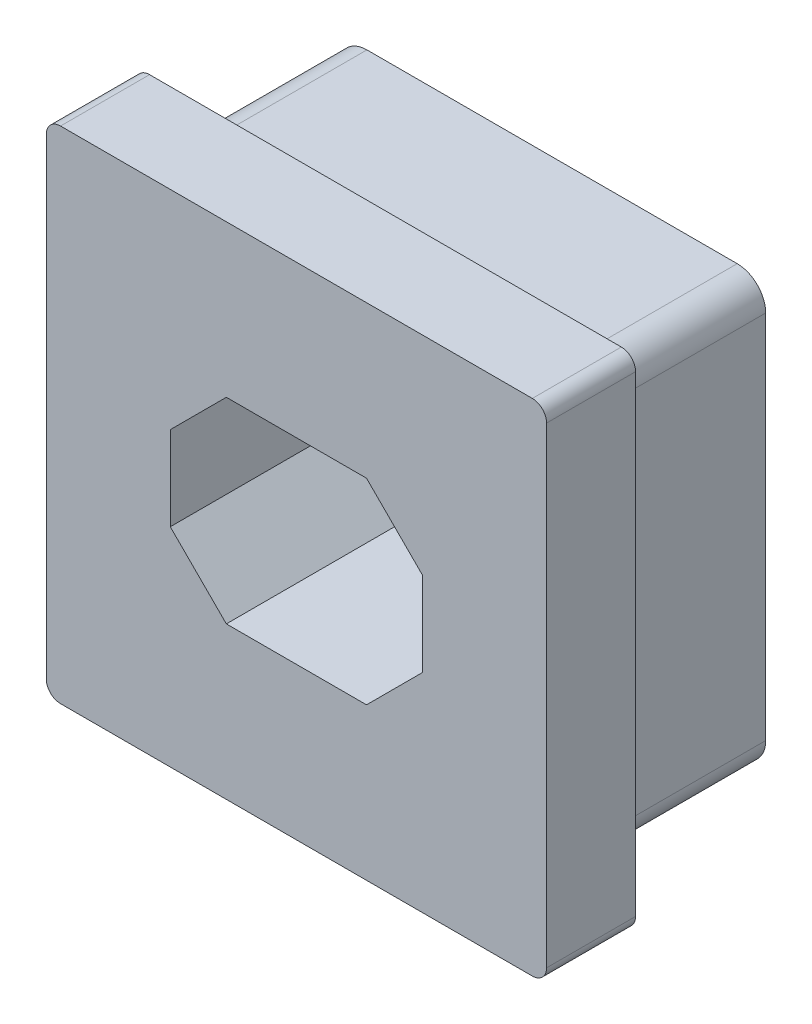
ISO-10303-21;
HEADER;
FILE_DESCRIPTION(('STEP AP214'),'2;1');
FILE_NAME('part.step','',(''),(''),'','','');
FILE_SCHEMA(('AUTOMOTIVE_DESIGN { 1 0 10303 214 1 1 1 1 }'));
ENDSEC;
DATA;
#1=APPLICATION_CONTEXT('core data for automotive mechanical design processes');
#2=APPLICATION_PROTOCOL_DEFINITION('international standard','automotive_design',2000,#1);
#3=PRODUCT_CONTEXT('',#1,'mechanical');
#4=PRODUCT('Part','Part','',(#3));
#5=PRODUCT_RELATED_PRODUCT_CATEGORY('part','',(#4));
#6=PRODUCT_DEFINITION_FORMATION('','',#4);
#7=PRODUCT_DEFINITION_CONTEXT('part definition',#1,'design');
#8=PRODUCT_DEFINITION('design','',#6,#7);
#9=PRODUCT_DEFINITION_SHAPE('','',#8);
#10=(LENGTH_UNIT() NAMED_UNIT(*) SI_UNIT(.MILLI.,.METRE.));
#11=(NAMED_UNIT(*) PLANE_ANGLE_UNIT() SI_UNIT($,.RADIAN.));
#12=(NAMED_UNIT(*) SI_UNIT($,.STERADIAN.) SOLID_ANGLE_UNIT());
#13=UNCERTAINTY_MEASURE_WITH_UNIT(LENGTH_MEASURE(1.E-05),#10,'distance_accuracy_value','');
#14=(GEOMETRIC_REPRESENTATION_CONTEXT(3) GLOBAL_UNCERTAINTY_ASSIGNED_CONTEXT((#13)) GLOBAL_UNIT_ASSIGNED_CONTEXT((#10,
#11,#12)) REPRESENTATION_CONTEXT('',''));
#15=CARTESIAN_POINT('',(0.,0.,0.));
#16=DIRECTION('',(0.,0.,1.));
#17=DIRECTION('',(1.,0.,0.));
#18=AXIS2_PLACEMENT_3D('',#15,#16,#17);
#19=CARTESIAN_POINT('',(4.207,4.207,0.));
#20=DIRECTION('',(0.,0.,1.));
#21=DIRECTION('',(1.,0.,0.));
#22=AXIS2_PLACEMENT_3D('',#19,#20,#21);
#23=PLANE('',#22);
#24=CARTESIAN_POINT('',(4.207,4.207,0.));
#25=DIRECTION('',(0.,0.,1.));
#26=DIRECTION('',(1.,0.,0.));
#27=AXIS2_PLACEMENT_3D('',#24,#25,#26);
#28=CIRCLE('',#27,0.254000000000002);
#29=CARTESIAN_POINT('',(4.461,4.207,0.));
#30=VERTEX_POINT('',#29);
#31=CARTESIAN_POINT('',(4.207,4.461,0.));
#32=VERTEX_POINT('',#31);
#33=EDGE_CURVE('E276',#30,#32,#28,.T.);
#34=ORIENTED_EDGE('',*,*,#33,.F.);
#35=DIRECTION('',(0.,1.,0.));
#36=VECTOR('',#35,1.);
#37=CARTESIAN_POINT('',(4.461,-4.207,0.));
#38=LINE('',#37,#36);
#39=CARTESIAN_POINT('',(4.461,-4.207,0.));
#40=VERTEX_POINT('',#39);
#41=EDGE_CURVE('E281',#40,#30,#38,.T.);
#42=ORIENTED_EDGE('',*,*,#41,.F.);
#43=CARTESIAN_POINT('',(4.207,-4.207,0.));
#44=DIRECTION('',(0.,0.,1.));
#45=DIRECTION('',(1.,0.,0.));
#46=AXIS2_PLACEMENT_3D('',#43,#44,#45);
#47=CIRCLE('',#46,0.254);
#48=CARTESIAN_POINT('',(4.207,-4.461,0.));
#49=VERTEX_POINT('',#48);
#50=EDGE_CURVE('E308',#49,#40,#47,.T.);
#51=ORIENTED_EDGE('',*,*,#50,.F.);
#52=DIRECTION('',(1.,0.,0.));
#53=VECTOR('',#52,1.);
#54=CARTESIAN_POINT('',(-4.207,-4.461,0.));
#55=LINE('',#54,#53);
#56=CARTESIAN_POINT('',(-4.207,-4.461,0.));
#57=VERTEX_POINT('',#56);
#58=EDGE_CURVE('E306',#57,#49,#55,.T.);
#59=ORIENTED_EDGE('',*,*,#58,.F.);
#60=CARTESIAN_POINT('',(-4.207,-4.207,0.));
#61=DIRECTION('',(0.,0.,1.));
#62=DIRECTION('',(1.,0.,0.));
#63=AXIS2_PLACEMENT_3D('',#60,#61,#62);
#64=CIRCLE('',#63,0.254000000000003);
#65=CARTESIAN_POINT('',(-4.461,-4.207,0.));
#66=VERTEX_POINT('',#65);
#67=EDGE_CURVE('E304',#66,#57,#64,.T.);
#68=ORIENTED_EDGE('',*,*,#67,.F.);
#69=DIRECTION('',(0.,-1.,0.));
#70=VECTOR('',#69,1.);
#71=CARTESIAN_POINT('',(-4.461,4.207,0.));
#72=LINE('',#71,#70);
#73=CARTESIAN_POINT('',(-4.461,4.207,0.));
#74=VERTEX_POINT('',#73);
#75=EDGE_CURVE('E302',#74,#66,#72,.T.);
#76=ORIENTED_EDGE('',*,*,#75,.F.);
#77=CARTESIAN_POINT('',(-4.207,4.207,0.));
#78=DIRECTION('',(0.,0.,1.));
#79=DIRECTION('',(1.,0.,0.));
#80=AXIS2_PLACEMENT_3D('',#77,#78,#79);
#81=CIRCLE('',#80,0.254);
#82=CARTESIAN_POINT('',(-4.207,4.461,0.));
#83=VERTEX_POINT('',#82);
#84=EDGE_CURVE('E300',#83,#74,#81,.T.);
#85=ORIENTED_EDGE('',*,*,#84,.F.);
#86=DIRECTION('',(-1.,0.,0.));
#87=VECTOR('',#86,1.);
#88=CARTESIAN_POINT('',(4.207,4.461,0.));
#89=LINE('',#88,#87);
#90=EDGE_CURVE('E298',#32,#83,#89,.T.);
#91=ORIENTED_EDGE('',*,*,#90,.F.);
#92=EDGE_LOOP('',(#34,#42,#51,#59,#68,#76,#85,#91));
#93=FACE_BOUND('',#92,.T.);
#94=DIRECTION('',(0.,-1.,0.));
#95=VECTOR('',#94,1.);
#96=CARTESIAN_POINT('',(3.81,-3.81,0.));
#97=LINE('',#96,#95);
#98=CARTESIAN_POINT('',(3.81,3.302,0.));
#99=VERTEX_POINT('',#98);
#100=CARTESIAN_POINT('',(3.81,-3.302,0.));
#101=VERTEX_POINT('',#100);
#102=EDGE_CURVE('E243',#99,#101,#97,.T.);
#103=ORIENTED_EDGE('',*,*,#102,.F.);
#104=CARTESIAN_POINT('',(3.302,3.302,0.));
#105=DIRECTION('',(0.,0.,1.));
#106=DIRECTION('',(1.,0.,0.));
#107=AXIS2_PLACEMENT_3D('',#104,#105,#106);
#108=CIRCLE('',#107,0.508);
#109=CARTESIAN_POINT('',(3.302,3.81,0.));
#110=VERTEX_POINT('',#109);
#111=EDGE_CURVE('E382',#99,#110,#108,.T.);
#112=ORIENTED_EDGE('',*,*,#111,.T.);
#113=DIRECTION('',(1.,0.,0.));
#114=VECTOR('',#113,1.);
#115=CARTESIAN_POINT('',(-3.81,3.81,0.));
#116=LINE('',#115,#114);
#117=CARTESIAN_POINT('',(-3.302,3.81,0.));
#118=VERTEX_POINT('',#117);
#119=EDGE_CURVE('E248',#118,#110,#116,.T.);
#120=ORIENTED_EDGE('',*,*,#119,.F.);
#121=CARTESIAN_POINT('',(-3.302,3.302,0.));
#122=DIRECTION('',(0.,0.,1.));
#123=DIRECTION('',(1.,0.,0.));
#124=AXIS2_PLACEMENT_3D('',#121,#122,#123);
#125=CIRCLE('',#124,0.508);
#126=CARTESIAN_POINT('',(-3.81,3.302,0.));
#127=VERTEX_POINT('',#126);
#128=EDGE_CURVE('E384',#118,#127,#125,.T.);
#129=ORIENTED_EDGE('',*,*,#128,.T.);
#130=DIRECTION('',(0.,1.,0.));
#131=VECTOR('',#130,1.);
#132=CARTESIAN_POINT('',(-3.81,-3.81,0.));
#133=LINE('',#132,#131);
#134=CARTESIAN_POINT('',(-3.81,-3.302,0.));
#135=VERTEX_POINT('',#134);
#136=EDGE_CURVE('E262',#135,#127,#133,.T.);
#137=ORIENTED_EDGE('',*,*,#136,.F.);
#138=CARTESIAN_POINT('',(-3.302,-3.302,0.));
#139=DIRECTION('',(0.,0.,1.));
#140=DIRECTION('',(1.,0.,0.));
#141=AXIS2_PLACEMENT_3D('',#138,#139,#140);
#142=CIRCLE('',#141,0.508);
#143=CARTESIAN_POINT('',(-3.302,-3.81,0.));
#144=VERTEX_POINT('',#143);
#145=EDGE_CURVE('E47',#135,#144,#142,.T.);
#146=ORIENTED_EDGE('',*,*,#145,.T.);
#147=DIRECTION('',(-1.,0.,0.));
#148=VECTOR('',#147,1.);
#149=CARTESIAN_POINT('',(-3.81,-3.81,0.));
#150=LINE('',#149,#148);
#151=CARTESIAN_POINT('',(3.302,-3.81,0.));
#152=VERTEX_POINT('',#151);
#153=EDGE_CURVE('E260',#152,#144,#150,.T.);
#154=ORIENTED_EDGE('',*,*,#153,.F.);
#155=CARTESIAN_POINT('',(3.302,-3.302,0.));
#156=DIRECTION('',(0.,0.,1.));
#157=DIRECTION('',(1.,0.,0.));
#158=AXIS2_PLACEMENT_3D('',#155,#156,#157);
#159=CIRCLE('',#158,0.508);
#160=EDGE_CURVE('E11',#152,#101,#159,.T.);
#161=ORIENTED_EDGE('',*,*,#160,.T.);
#162=EDGE_LOOP('',(#103,#112,#120,#129,#137,#146,#154,#161));
#163=FACE_BOUND('',#162,.T.);
#164=ADVANCED_FACE('F39',(#93,#163),#23,.F.);
#165=CARTESIAN_POINT('',(4.207,4.207,1.5875));
#166=DIRECTION('',(0.,0.,-1.));
#167=DIRECTION('',(-1.,0.,0.));
#168=AXIS2_PLACEMENT_3D('',#165,#166,#167);
#169=CYLINDRICAL_SURFACE('',#168,0.254000000000002);
#170=ORIENTED_EDGE('',*,*,#33,.T.);
#171=DIRECTION('',(0.,0.,-1.));
#172=VECTOR('',#171,1.);
#173=CARTESIAN_POINT('',(4.207,4.461,1.5875));
#174=LINE('',#173,#172);
#175=CARTESIAN_POINT('',(4.207,4.461,1.5875));
#176=VERTEX_POINT('',#175);
#177=EDGE_CURVE('E331',#176,#32,#174,.T.);
#178=ORIENTED_EDGE('',*,*,#177,.F.);
#179=CARTESIAN_POINT('',(4.207,4.207,1.5875));
#180=DIRECTION('',(0.,0.,1.));
#181=DIRECTION('',(1.,0.,0.));
#182=AXIS2_PLACEMENT_3D('',#179,#180,#181);
#183=CIRCLE('',#182,0.254000000000002);
#184=CARTESIAN_POINT('',(4.461,4.207,1.5875));
#185=VERTEX_POINT('',#184);
#186=EDGE_CURVE('E277',#185,#176,#183,.T.);
#187=ORIENTED_EDGE('',*,*,#186,.F.);
#188=DIRECTION('',(0.,0.,-1.));
#189=VECTOR('',#188,1.);
#190=CARTESIAN_POINT('',(4.461,4.207,1.5875));
#191=LINE('',#190,#189);
#192=EDGE_CURVE('E295',#185,#30,#191,.T.);
#193=ORIENTED_EDGE('',*,*,#192,.T.);
#194=EDGE_LOOP('',(#170,#178,#187,#193));
#195=FACE_BOUND('',#194,.T.);
#196=ADVANCED_FACE('F423',(#195),#169,.T.);
#197=CARTESIAN_POINT('',(4.207,4.461,1.5875));
#198=DIRECTION('',(0.,-1.,0.));
#199=DIRECTION('',(0.,0.,-1.));
#200=AXIS2_PLACEMENT_3D('',#197,#198,#199);
#201=PLANE('',#200);
#202=ORIENTED_EDGE('',*,*,#90,.T.);
#203=DIRECTION('',(0.,0.,-1.));
#204=VECTOR('',#203,1.);
#205=CARTESIAN_POINT('',(-4.207,4.461,1.5875));
#206=LINE('',#205,#204);
#207=CARTESIAN_POINT('',(-4.207,4.461,1.5875));
#208=VERTEX_POINT('',#207);
#209=EDGE_CURVE('E328',#208,#83,#206,.T.);
#210=ORIENTED_EDGE('',*,*,#209,.F.);
#211=DIRECTION('',(-1.,0.,0.));
#212=VECTOR('',#211,1.);
#213=CARTESIAN_POINT('',(4.207,4.461,1.5875));
#214=LINE('',#213,#212);
#215=EDGE_CURVE('E280',#176,#208,#214,.T.);
#216=ORIENTED_EDGE('',*,*,#215,.F.);
#217=ORIENTED_EDGE('',*,*,#177,.T.);
#218=EDGE_LOOP('',(#202,#210,#216,#217));
#219=FACE_BOUND('',#218,.T.);
#220=ADVANCED_FACE('F431',(#219),#201,.F.);
#221=CARTESIAN_POINT('',(-4.207,4.207,1.5875));
#222=DIRECTION('',(0.,0.,-1.));
#223=DIRECTION('',(-1.,0.,0.));
#224=AXIS2_PLACEMENT_3D('',#221,#222,#223);
#225=CYLINDRICAL_SURFACE('',#224,0.254);
#226=ORIENTED_EDGE('',*,*,#84,.T.);
#227=DIRECTION('',(0.,0.,-1.));
#228=VECTOR('',#227,1.);
#229=CARTESIAN_POINT('',(-4.461,4.207,1.5875));
#230=LINE('',#229,#228);
#231=CARTESIAN_POINT('',(-4.461,4.207,1.5875));
#232=VERTEX_POINT('',#231);
#233=EDGE_CURVE('E325',#232,#74,#230,.T.);
#234=ORIENTED_EDGE('',*,*,#233,.F.);
#235=CARTESIAN_POINT('',(-4.207,4.207,1.5875));
#236=DIRECTION('',(0.,0.,1.));
#237=DIRECTION('',(1.,0.,0.));
#238=AXIS2_PLACEMENT_3D('',#235,#236,#237);
#239=CIRCLE('',#238,0.254);
#240=EDGE_CURVE('E283',#208,#232,#239,.T.);
#241=ORIENTED_EDGE('',*,*,#240,.F.);
#242=ORIENTED_EDGE('',*,*,#209,.T.);
#243=EDGE_LOOP('',(#226,#234,#241,#242));
#244=FACE_BOUND('',#243,.T.);
#245=ADVANCED_FACE('F458',(#244),#225,.T.);
#246=CARTESIAN_POINT('',(-4.461,4.207,1.5875));
#247=DIRECTION('',(1.,0.,0.));
#248=DIRECTION('',(0.,0.,-1.));
#249=AXIS2_PLACEMENT_3D('',#246,#247,#248);
#250=PLANE('',#249);
#251=ORIENTED_EDGE('',*,*,#75,.T.);
#252=DIRECTION('',(0.,0.,-1.));
#253=VECTOR('',#252,1.);
#254=CARTESIAN_POINT('',(-4.461,-4.207,1.5875));
#255=LINE('',#254,#253);
#256=CARTESIAN_POINT('',(-4.461,-4.207,1.5875));
#257=VERTEX_POINT('',#256);
#258=EDGE_CURVE('E322',#257,#66,#255,.T.);
#259=ORIENTED_EDGE('',*,*,#258,.F.);
#260=DIRECTION('',(0.,-1.,0.));
#261=VECTOR('',#260,1.);
#262=CARTESIAN_POINT('',(-4.461,4.207,1.5875));
#263=LINE('',#262,#261);
#264=EDGE_CURVE('E285',#232,#257,#263,.T.);
#265=ORIENTED_EDGE('',*,*,#264,.F.);
#266=ORIENTED_EDGE('',*,*,#233,.T.);
#267=EDGE_LOOP('',(#251,#259,#265,#266));
#268=FACE_BOUND('',#267,.T.);
#269=ADVANCED_FACE('F454',(#268),#250,.F.);
#270=CARTESIAN_POINT('',(-4.207,-4.207,1.5875));
#271=DIRECTION('',(0.,0.,-1.));
#272=DIRECTION('',(-1.,0.,0.));
#273=AXIS2_PLACEMENT_3D('',#270,#271,#272);
#274=CYLINDRICAL_SURFACE('',#273,0.254000000000003);
#275=ORIENTED_EDGE('',*,*,#67,.T.);
#276=DIRECTION('',(0.,0.,-1.));
#277=VECTOR('',#276,1.);
#278=CARTESIAN_POINT('',(-4.207,-4.461,1.5875));
#279=LINE('',#278,#277);
#280=CARTESIAN_POINT('',(-4.207,-4.461,1.5875));
#281=VERTEX_POINT('',#280);
#282=EDGE_CURVE('E319',#281,#57,#279,.T.);
#283=ORIENTED_EDGE('',*,*,#282,.F.);
#284=CARTESIAN_POINT('',(-4.207,-4.207,1.5875));
#285=DIRECTION('',(0.,0.,1.));
#286=DIRECTION('',(1.,0.,0.));
#287=AXIS2_PLACEMENT_3D('',#284,#285,#286);
#288=CIRCLE('',#287,0.254000000000003);
#289=EDGE_CURVE('E287',#257,#281,#288,.T.);
#290=ORIENTED_EDGE('',*,*,#289,.F.);
#291=ORIENTED_EDGE('',*,*,#258,.T.);
#292=EDGE_LOOP('',(#275,#283,#290,#291));
#293=FACE_BOUND('',#292,.T.);
#294=ADVANCED_FACE('F450',(#293),#274,.T.);
#295=CARTESIAN_POINT('',(-4.207,-4.461,1.5875));
#296=DIRECTION('',(0.,1.,0.));
#297=DIRECTION('',(0.,0.,1.));
#298=AXIS2_PLACEMENT_3D('',#295,#296,#297);
#299=PLANE('',#298);
#300=ORIENTED_EDGE('',*,*,#58,.T.);
#301=DIRECTION('',(0.,0.,-1.));
#302=VECTOR('',#301,1.);
#303=CARTESIAN_POINT('',(4.207,-4.461,1.5875));
#304=LINE('',#303,#302);
#305=CARTESIAN_POINT('',(4.207,-4.461,1.5875));
#306=VERTEX_POINT('',#305);
#307=EDGE_CURVE('E316',#306,#49,#304,.T.);
#308=ORIENTED_EDGE('',*,*,#307,.F.);
#309=DIRECTION('',(1.,0.,0.));
#310=VECTOR('',#309,1.);
#311=CARTESIAN_POINT('',(-4.207,-4.461,1.5875));
#312=LINE('',#311,#310);
#313=EDGE_CURVE('E289',#281,#306,#312,.T.);
#314=ORIENTED_EDGE('',*,*,#313,.F.);
#315=ORIENTED_EDGE('',*,*,#282,.T.);
#316=EDGE_LOOP('',(#300,#308,#314,#315));
#317=FACE_BOUND('',#316,.T.);
#318=ADVANCED_FACE('F446',(#317),#299,.F.);
#319=CARTESIAN_POINT('',(4.207,-4.207,1.5875));
#320=DIRECTION('',(0.,0.,-1.));
#321=DIRECTION('',(-1.,0.,0.));
#322=AXIS2_PLACEMENT_3D('',#319,#320,#321);
#323=CYLINDRICAL_SURFACE('',#322,0.254);
#324=ORIENTED_EDGE('',*,*,#50,.T.);
#325=DIRECTION('',(0.,0.,-1.));
#326=VECTOR('',#325,1.);
#327=CARTESIAN_POINT('',(4.461,-4.207,1.5875));
#328=LINE('',#327,#326);
#329=CARTESIAN_POINT('',(4.461,-4.207,1.5875));
#330=VERTEX_POINT('',#329);
#331=EDGE_CURVE('E313',#330,#40,#328,.T.);
#332=ORIENTED_EDGE('',*,*,#331,.F.);
#333=CARTESIAN_POINT('',(4.207,-4.207,1.5875));
#334=DIRECTION('',(0.,0.,1.));
#335=DIRECTION('',(1.,0.,0.));
#336=AXIS2_PLACEMENT_3D('',#333,#334,#335);
#337=CIRCLE('',#336,0.254);
#338=EDGE_CURVE('E291',#306,#330,#337,.T.);
#339=ORIENTED_EDGE('',*,*,#338,.F.);
#340=ORIENTED_EDGE('',*,*,#307,.T.);
#341=EDGE_LOOP('',(#324,#332,#339,#340));
#342=FACE_BOUND('',#341,.T.);
#343=ADVANCED_FACE('F442',(#342),#323,.T.);
#344=CARTESIAN_POINT('',(4.461,-4.207,1.5875));
#345=DIRECTION('',(-1.,0.,0.));
#346=DIRECTION('',(0.,0.,1.));
#347=AXIS2_PLACEMENT_3D('',#344,#345,#346);
#348=PLANE('',#347);
#349=ORIENTED_EDGE('',*,*,#41,.T.);
#350=ORIENTED_EDGE('',*,*,#192,.F.);
#351=DIRECTION('',(0.,1.,0.));
#352=VECTOR('',#351,1.);
#353=CARTESIAN_POINT('',(4.461,-4.207,1.5875));
#354=LINE('',#353,#352);
#355=EDGE_CURVE('E293',#330,#185,#354,.T.);
#356=ORIENTED_EDGE('',*,*,#355,.F.);
#357=ORIENTED_EDGE('',*,*,#331,.T.);
#358=EDGE_LOOP('',(#349,#350,#356,#357));
#359=FACE_BOUND('',#358,.T.);
#360=ADVANCED_FACE('F439',(#359),#348,.F.);
#361=CARTESIAN_POINT('',(4.207,4.207,1.5875));
#362=DIRECTION('',(0.,0.,1.));
#363=DIRECTION('',(1.,0.,0.));
#364=AXIS2_PLACEMENT_3D('',#361,#362,#363);
#365=PLANE('',#364);
#366=DIRECTION('',(0.,1.,0.));
#367=VECTOR('',#366,1.);
#368=CARTESIAN_POINT('',(2.25,1.75,1.5875));
#369=LINE('',#368,#367);
#370=CARTESIAN_POINT('',(2.25,-0.749999999999994,1.5875));
#371=VERTEX_POINT('',#370);
#372=CARTESIAN_POINT('',(2.25,0.750000000000004,1.5875));
#373=VERTEX_POINT('',#372);
#374=EDGE_CURVE('E257',#371,#373,#369,.T.);
#375=ORIENTED_EDGE('',*,*,#374,.F.);
#376=DIRECTION('',(0.707106781186544,0.707106781186551,0.));
#377=VECTOR('',#376,1.);
#378=CARTESIAN_POINT('',(2.25,-0.749999999999994,1.5875));
#379=LINE('',#378,#377);
#380=CARTESIAN_POINT('',(1.25000000000001,-1.75,1.5875));
#381=VERTEX_POINT('',#380);
#382=EDGE_CURVE('E349',#371,#381,#379,.F.);
#383=ORIENTED_EDGE('',*,*,#382,.T.);
#384=DIRECTION('',(1.,0.,0.));
#385=VECTOR('',#384,1.);
#386=CARTESIAN_POINT('',(-2.25,-1.75,1.5875));
#387=LINE('',#386,#385);
#388=CARTESIAN_POINT('',(-1.24999999999999,-1.75,1.5875));
#389=VERTEX_POINT('',#388);
#390=EDGE_CURVE('E273',#389,#381,#387,.T.);
#391=ORIENTED_EDGE('',*,*,#390,.F.);
#392=DIRECTION('',(0.707106781186551,-0.707106781186544,0.));
#393=VECTOR('',#392,1.);
#394=CARTESIAN_POINT('',(-1.24999999999999,-1.75,1.5875));
#395=LINE('',#394,#393);
#396=CARTESIAN_POINT('',(-2.25,-0.750000000000003,1.5875));
#397=VERTEX_POINT('',#396);
#398=EDGE_CURVE('E347',#389,#397,#395,.F.);
#399=ORIENTED_EDGE('',*,*,#398,.T.);
#400=DIRECTION('',(0.,-1.,0.));
#401=VECTOR('',#400,1.);
#402=CARTESIAN_POINT('',(-2.25,1.75,1.5875));
#403=LINE('',#402,#401);
#404=CARTESIAN_POINT('',(-2.25,0.749999999999994,1.5875));
#405=VERTEX_POINT('',#404);
#406=EDGE_CURVE('E270',#405,#397,#403,.T.);
#407=ORIENTED_EDGE('',*,*,#406,.F.);
#408=DIRECTION('',(-0.707106781186544,-0.707106781186551,0.));
#409=VECTOR('',#408,1.);
#410=CARTESIAN_POINT('',(-2.25,0.749999999999994,1.5875));
#411=LINE('',#410,#409);
#412=CARTESIAN_POINT('',(-1.25,1.75,1.5875));
#413=VERTEX_POINT('',#412);
#414=EDGE_CURVE('E353',#405,#413,#411,.F.);
#415=ORIENTED_EDGE('',*,*,#414,.T.);
#416=DIRECTION('',(-1.,0.,0.));
#417=VECTOR('',#416,1.);
#418=CARTESIAN_POINT('',(-2.25,1.75,1.5875));
#419=LINE('',#418,#417);
#420=CARTESIAN_POINT('',(1.25,1.75,1.5875));
#421=VERTEX_POINT('',#420);
#422=EDGE_CURVE('E208',#421,#413,#419,.T.);
#423=ORIENTED_EDGE('',*,*,#422,.F.);
#424=DIRECTION('',(-0.707106781186551,0.707106781186544,0.));
#425=VECTOR('',#424,1.);
#426=CARTESIAN_POINT('',(1.25,1.75,1.5875));
#427=LINE('',#426,#425);
#428=EDGE_CURVE('E351',#421,#373,#427,.F.);
#429=ORIENTED_EDGE('',*,*,#428,.T.);
#430=EDGE_LOOP('',(#375,#383,#391,#399,#407,#415,#423,#429));
#431=FACE_BOUND('',#430,.T.);
#432=ORIENTED_EDGE('',*,*,#186,.T.);
#433=ORIENTED_EDGE('',*,*,#215,.T.);
#434=ORIENTED_EDGE('',*,*,#240,.T.);
#435=ORIENTED_EDGE('',*,*,#264,.T.);
#436=ORIENTED_EDGE('',*,*,#289,.T.);
#437=ORIENTED_EDGE('',*,*,#313,.T.);
#438=ORIENTED_EDGE('',*,*,#338,.T.);
#439=ORIENTED_EDGE('',*,*,#355,.T.);
#440=EDGE_LOOP('',(#432,#433,#434,#435,#436,#437,#438,#439));
#441=FACE_BOUND('',#440,.T.);
#442=ADVANCED_FACE('F437',(#431,#441),#365,.T.);
#443=CARTESIAN_POINT('',(2.25,1.75,0.));
#444=DIRECTION('',(1.,0.,0.));
#445=DIRECTION('',(0.,1.,0.));
#446=AXIS2_PLACEMENT_3D('',#443,#444,#445);
#447=PLANE('',#446);
#448=DIRECTION('',(0.,0.,-1.));
#449=VECTOR('',#448,1.);
#450=CARTESIAN_POINT('',(2.25,0.750000000000004,0.));
#451=LINE('',#450,#449);
#452=CARTESIAN_POINT('',(2.25,0.750000000000004,-2.9718));
#453=VERTEX_POINT('',#452);
#454=EDGE_CURVE('E342',#373,#453,#451,.T.);
#455=ORIENTED_EDGE('',*,*,#454,.T.);
#456=DIRECTION('',(0.,-1.,0.));
#457=VECTOR('',#456,1.);
#458=CARTESIAN_POINT('',(2.25,0.750000000000004,-2.9718));
#459=LINE('',#458,#457);
#460=CARTESIAN_POINT('',(2.25,-0.749999999999994,-2.9718));
#461=VERTEX_POINT('',#460);
#462=EDGE_CURVE('E227',#453,#461,#459,.T.);
#463=ORIENTED_EDGE('',*,*,#462,.T.);
#464=DIRECTION('',(0.,0.,1.));
#465=VECTOR('',#464,1.);
#466=CARTESIAN_POINT('',(2.25,-0.749999999999994,1.5875));
#467=LINE('',#466,#465);
#468=EDGE_CURVE('E211',#461,#371,#467,.T.);
#469=ORIENTED_EDGE('',*,*,#468,.T.);
#470=ORIENTED_EDGE('',*,*,#374,.T.);
#471=EDGE_LOOP('',(#455,#463,#469,#470));
#472=FACE_BOUND('',#471,.T.);
#473=ADVANCED_FACE('F499',(#472),#447,.F.);
#474=CARTESIAN_POINT('',(-2.25,-1.75,0.));
#475=DIRECTION('',(0.,-1.,0.));
#476=DIRECTION('',(0.,0.,-1.));
#477=AXIS2_PLACEMENT_3D('',#474,#475,#476);
#478=PLANE('',#477);
#479=DIRECTION('',(0.,0.,-1.));
#480=VECTOR('',#479,1.);
#481=CARTESIAN_POINT('',(1.25000000000001,-1.75,0.));
#482=LINE('',#481,#480);
#483=CARTESIAN_POINT('',(1.25000000000001,-1.75,-2.9718));
#484=VERTEX_POINT('',#483);
#485=EDGE_CURVE('E334',#381,#484,#482,.T.);
#486=ORIENTED_EDGE('',*,*,#485,.T.);
#487=DIRECTION('',(-1.,0.,0.));
#488=VECTOR('',#487,1.);
#489=CARTESIAN_POINT('',(1.25000000000001,-1.75,-2.9718));
#490=LINE('',#489,#488);
#491=CARTESIAN_POINT('',(-1.24999999999999,-1.75,-2.9718));
#492=VERTEX_POINT('',#491);
#493=EDGE_CURVE('E235',#484,#492,#490,.T.);
#494=ORIENTED_EDGE('',*,*,#493,.T.);
#495=DIRECTION('',(0.,0.,1.));
#496=VECTOR('',#495,1.);
#497=CARTESIAN_POINT('',(-1.24999999999999,-1.75,1.5875));
#498=LINE('',#497,#496);
#499=EDGE_CURVE('E336',#492,#389,#498,.T.);
#500=ORIENTED_EDGE('',*,*,#499,.T.);
#501=ORIENTED_EDGE('',*,*,#390,.T.);
#502=EDGE_LOOP('',(#486,#494,#500,#501));
#503=FACE_BOUND('',#502,.T.);
#504=ADVANCED_FACE('F495',(#503),#478,.F.);
#505=CARTESIAN_POINT('',(-2.25,1.75,0.));
#506=DIRECTION('',(-1.,0.,0.));
#507=DIRECTION('',(0.,-1.,0.));
#508=AXIS2_PLACEMENT_3D('',#505,#506,#507);
#509=PLANE('',#508);
#510=ORIENTED_EDGE('',*,*,#406,.T.);
#511=DIRECTION('',(0.,0.,-1.));
#512=VECTOR('',#511,1.);
#513=CARTESIAN_POINT('',(-2.25,-0.750000000000004,0.));
#514=LINE('',#513,#512);
#515=CARTESIAN_POINT('',(-2.25,-0.750000000000003,-2.9718));
#516=VERTEX_POINT('',#515);
#517=EDGE_CURVE('E340',#397,#516,#514,.T.);
#518=ORIENTED_EDGE('',*,*,#517,.T.);
#519=DIRECTION('',(0.,1.,0.));
#520=VECTOR('',#519,1.);
#521=CARTESIAN_POINT('',(-2.25,-0.750000000000003,-2.9718));
#522=LINE('',#521,#520);
#523=CARTESIAN_POINT('',(-2.25,0.749999999999994,-2.9718));
#524=VERTEX_POINT('',#523);
#525=EDGE_CURVE('E241',#516,#524,#522,.T.);
#526=ORIENTED_EDGE('',*,*,#525,.T.);
#527=DIRECTION('',(0.,0.,1.));
#528=VECTOR('',#527,1.);
#529=CARTESIAN_POINT('',(-2.25,0.749999999999994,1.5875));
#530=LINE('',#529,#528);
#531=EDGE_CURVE('E217',#524,#405,#530,.T.);
#532=ORIENTED_EDGE('',*,*,#531,.T.);
#533=EDGE_LOOP('',(#510,#518,#526,#532));
#534=FACE_BOUND('',#533,.T.);
#535=ADVANCED_FACE('F498',(#534),#509,.F.);
#536=CARTESIAN_POINT('',(-2.25,1.75,0.));
#537=DIRECTION('',(0.,1.,0.));
#538=DIRECTION('',(-1.,0.,0.));
#539=AXIS2_PLACEMENT_3D('',#536,#537,#538);
#540=PLANE('',#539);
#541=DIRECTION('',(0.,0.,-1.));
#542=VECTOR('',#541,1.);
#543=CARTESIAN_POINT('',(-1.25,1.75,0.));
#544=LINE('',#543,#542);
#545=CARTESIAN_POINT('',(-1.25,1.75,-2.9718));
#546=VERTEX_POINT('',#545);
#547=EDGE_CURVE('E200',#413,#546,#544,.T.);
#548=ORIENTED_EDGE('',*,*,#547,.T.);
#549=DIRECTION('',(1.,0.,0.));
#550=VECTOR('',#549,1.);
#551=CARTESIAN_POINT('',(-1.25,1.75,-2.9718));
#552=LINE('',#551,#550);
#553=CARTESIAN_POINT('',(1.25,1.75,-2.9718));
#554=VERTEX_POINT('',#553);
#555=EDGE_CURVE('E205',#546,#554,#552,.T.);
#556=ORIENTED_EDGE('',*,*,#555,.T.);
#557=DIRECTION('',(0.,0.,1.));
#558=VECTOR('',#557,1.);
#559=CARTESIAN_POINT('',(1.25,1.75,1.5875));
#560=LINE('',#559,#558);
#561=EDGE_CURVE('E210',#554,#421,#560,.T.);
#562=ORIENTED_EDGE('',*,*,#561,.T.);
#563=ORIENTED_EDGE('',*,*,#422,.T.);
#564=EDGE_LOOP('',(#548,#556,#562,#563));
#565=FACE_BOUND('',#564,.T.);
#566=ADVANCED_FACE('F202',(#565),#540,.F.);
#567=CARTESIAN_POINT('',(-1.24999999999999,-1.75,0.));
#568=DIRECTION('',(0.707106781186544,0.707106781186551,0.));
#569=DIRECTION('',(0.,0.,-1.));
#570=AXIS2_PLACEMENT_3D('',#567,#568,#569);
#571=PLANE('',#570);
#572=ORIENTED_EDGE('',*,*,#499,.F.);
#573=DIRECTION('',(-0.707106781186551,0.707106781186544,0.));
#574=VECTOR('',#573,1.);
#575=CARTESIAN_POINT('',(-1.24999999999999,-1.75,-2.9718));
#576=LINE('',#575,#574);
#577=EDGE_CURVE('E238',#492,#516,#576,.T.);
#578=ORIENTED_EDGE('',*,*,#577,.T.);
#579=ORIENTED_EDGE('',*,*,#517,.F.);
#580=ORIENTED_EDGE('',*,*,#398,.F.);
#581=EDGE_LOOP('',(#572,#578,#579,#580));
#582=FACE_BOUND('',#581,.T.);
#583=ADVANCED_FACE('F466',(#582),#571,.T.);
#584=CARTESIAN_POINT('',(2.25,-0.749999999999994,0.));
#585=DIRECTION('',(-0.707106781186551,0.707106781186544,0.));
#586=DIRECTION('',(0.,0.,-1.));
#587=AXIS2_PLACEMENT_3D('',#584,#585,#586);
#588=PLANE('',#587);
#589=ORIENTED_EDGE('',*,*,#468,.F.);
#590=DIRECTION('',(-0.707106781186544,-0.707106781186551,0.));
#591=VECTOR('',#590,1.);
#592=CARTESIAN_POINT('',(2.25,-0.749999999999994,-2.9718));
#593=LINE('',#592,#591);
#594=EDGE_CURVE('E232',#461,#484,#593,.T.);
#595=ORIENTED_EDGE('',*,*,#594,.T.);
#596=ORIENTED_EDGE('',*,*,#485,.F.);
#597=ORIENTED_EDGE('',*,*,#382,.F.);
#598=EDGE_LOOP('',(#589,#595,#596,#597));
#599=FACE_BOUND('',#598,.T.);
#600=ADVANCED_FACE('F469',(#599),#588,.T.);
#601=CARTESIAN_POINT('',(1.25,1.75,0.));
#602=DIRECTION('',(-0.707106781186544,-0.707106781186551,0.));
#603=DIRECTION('',(0.,0.,-1.));
#604=AXIS2_PLACEMENT_3D('',#601,#602,#603);
#605=PLANE('',#604);
#606=ORIENTED_EDGE('',*,*,#561,.F.);
#607=DIRECTION('',(0.707106781186551,-0.707106781186544,0.));
#608=VECTOR('',#607,1.);
#609=CARTESIAN_POINT('',(1.25,1.75,-2.9718));
#610=LINE('',#609,#608);
#611=EDGE_CURVE('E225',#554,#453,#610,.T.);
#612=ORIENTED_EDGE('',*,*,#611,.T.);
#613=ORIENTED_EDGE('',*,*,#454,.F.);
#614=ORIENTED_EDGE('',*,*,#428,.F.);
#615=EDGE_LOOP('',(#606,#612,#613,#614));
#616=FACE_BOUND('',#615,.T.);
#617=ADVANCED_FACE('F473',(#616),#605,.T.);
#618=CARTESIAN_POINT('',(-2.25,0.749999999999994,0.));
#619=DIRECTION('',(0.707106781186551,-0.707106781186544,0.));
#620=DIRECTION('',(0.,0.,-1.));
#621=AXIS2_PLACEMENT_3D('',#618,#619,#620);
#622=PLANE('',#621);
#623=ORIENTED_EDGE('',*,*,#531,.F.);
#624=DIRECTION('',(0.707106781186544,0.707106781186551,0.));
#625=VECTOR('',#624,1.);
#626=CARTESIAN_POINT('',(-2.25,0.749999999999994,-2.9718));
#627=LINE('',#626,#625);
#628=EDGE_CURVE('E214',#524,#546,#627,.T.);
#629=ORIENTED_EDGE('',*,*,#628,.T.);
#630=ORIENTED_EDGE('',*,*,#547,.F.);
#631=ORIENTED_EDGE('',*,*,#414,.F.);
#632=EDGE_LOOP('',(#623,#629,#630,#631));
#633=FACE_BOUND('',#632,.T.);
#634=ADVANCED_FACE('F215',(#633),#622,.T.);
#635=CARTESIAN_POINT('',(0.,0.,-2.9718));
#636=DIRECTION('',(0.,0.,-1.));
#637=DIRECTION('',(-1.,0.,0.));
#638=AXIS2_PLACEMENT_3D('',#635,#636,#637);
#639=PLANE('',#638);
#640=DIRECTION('',(1.,0.,0.));
#641=VECTOR('',#640,1.);
#642=CARTESIAN_POINT('',(-3.81,3.81,-2.9718));
#643=LINE('',#642,#641);
#644=CARTESIAN_POINT('',(-3.302,3.81,-2.9718));
#645=VERTEX_POINT('',#644);
#646=CARTESIAN_POINT('',(3.302,3.81,-2.9718));
#647=VERTEX_POINT('',#646);
#648=EDGE_CURVE('E254',#645,#647,#643,.T.);
#649=ORIENTED_EDGE('',*,*,#648,.T.);
#650=CARTESIAN_POINT('',(3.302,3.302,-2.9718));
#651=DIRECTION('',(0.,0.,-1.));
#652=DIRECTION('',(-1.,0.,0.));
#653=AXIS2_PLACEMENT_3D('',#650,#651,#652);
#654=CIRCLE('',#653,0.508);
#655=CARTESIAN_POINT('',(3.81,3.302,-2.9718));
#656=VERTEX_POINT('',#655);
#657=EDGE_CURVE('E371',#647,#656,#654,.T.);
#658=ORIENTED_EDGE('',*,*,#657,.T.);
#659=DIRECTION('',(0.,-1.,0.));
#660=VECTOR('',#659,1.);
#661=CARTESIAN_POINT('',(3.81,-3.81,-2.9718));
#662=LINE('',#661,#660);
#663=CARTESIAN_POINT('',(3.81,-3.302,-2.9718));
#664=VERTEX_POINT('',#663);
#665=EDGE_CURVE('E244',#656,#664,#662,.T.);
#666=ORIENTED_EDGE('',*,*,#665,.T.);
#667=CARTESIAN_POINT('',(3.302,-3.302,-2.9718));
#668=DIRECTION('',(0.,0.,-1.));
#669=DIRECTION('',(-1.,0.,0.));
#670=AXIS2_PLACEMENT_3D('',#667,#668,#669);
#671=CIRCLE('',#670,0.508);
#672=CARTESIAN_POINT('',(3.302,-3.81,-2.9718));
#673=VERTEX_POINT('',#672);
#674=EDGE_CURVE('E365',#664,#673,#671,.T.);
#675=ORIENTED_EDGE('',*,*,#674,.T.);
#676=DIRECTION('',(-1.,0.,0.));
#677=VECTOR('',#676,1.);
#678=CARTESIAN_POINT('',(-3.81,-3.81,-2.9718));
#679=LINE('',#678,#677);
#680=CARTESIAN_POINT('',(-3.302,-3.81,-2.9718));
#681=VERTEX_POINT('',#680);
#682=EDGE_CURVE('E247',#673,#681,#679,.T.);
#683=ORIENTED_EDGE('',*,*,#682,.T.);
#684=CARTESIAN_POINT('',(-3.302,-3.302,-2.9718));
#685=DIRECTION('',(0.,0.,-1.));
#686=DIRECTION('',(-1.,0.,0.));
#687=AXIS2_PLACEMENT_3D('',#684,#685,#686);
#688=CIRCLE('',#687,0.508);
#689=CARTESIAN_POINT('',(-3.81,-3.302,-2.9718));
#690=VERTEX_POINT('',#689);
#691=EDGE_CURVE('E367',#681,#690,#688,.T.);
#692=ORIENTED_EDGE('',*,*,#691,.T.);
#693=DIRECTION('',(0.,1.,0.));
#694=VECTOR('',#693,1.);
#695=CARTESIAN_POINT('',(-3.81,-3.81,-2.9718));
#696=LINE('',#695,#694);
#697=CARTESIAN_POINT('',(-3.81,3.302,-2.9718));
#698=VERTEX_POINT('',#697);
#699=EDGE_CURVE('E251',#690,#698,#696,.T.);
#700=ORIENTED_EDGE('',*,*,#699,.T.);
#701=CARTESIAN_POINT('',(-3.302,3.302,-2.9718));
#702=DIRECTION('',(0.,0.,-1.));
#703=DIRECTION('',(-1.,0.,0.));
#704=AXIS2_PLACEMENT_3D('',#701,#702,#703);
#705=CIRCLE('',#704,0.508);
#706=EDGE_CURVE('E369',#698,#645,#705,.T.);
#707=ORIENTED_EDGE('',*,*,#706,.T.);
#708=EDGE_LOOP('',(#649,#658,#666,#675,#683,#692,#700,#707));
#709=FACE_BOUND('',#708,.T.);
#710=ORIENTED_EDGE('',*,*,#555,.F.);
#711=ORIENTED_EDGE('',*,*,#628,.F.);
#712=ORIENTED_EDGE('',*,*,#525,.F.);
#713=ORIENTED_EDGE('',*,*,#577,.F.);
#714=ORIENTED_EDGE('',*,*,#493,.F.);
#715=ORIENTED_EDGE('',*,*,#594,.F.);
#716=ORIENTED_EDGE('',*,*,#462,.F.);
#717=ORIENTED_EDGE('',*,*,#611,.F.);
#718=EDGE_LOOP('',(#710,#711,#712,#713,#714,#715,#716,#717));
#719=FACE_BOUND('',#718,.T.);
#720=ADVANCED_FACE('F222',(#709,#719),#639,.T.);
#721=CARTESIAN_POINT('',(3.81,-3.81,-2.9718));
#722=DIRECTION('',(-1.,0.,0.));
#723=DIRECTION('',(0.,0.,1.));
#724=AXIS2_PLACEMENT_3D('',#721,#722,#723);
#725=PLANE('',#724);
#726=ORIENTED_EDGE('',*,*,#665,.F.);
#727=DIRECTION('',(0.,0.,1.));
#728=VECTOR('',#727,1.);
#729=CARTESIAN_POINT('',(3.81,3.302,-2.9718));
#730=LINE('',#729,#728);
#731=EDGE_CURVE('E357',#656,#99,#730,.T.);
#732=ORIENTED_EDGE('',*,*,#731,.T.);
#733=ORIENTED_EDGE('',*,*,#102,.T.);
#734=DIRECTION('',(0.,0.,1.));
#735=VECTOR('',#734,1.);
#736=CARTESIAN_POINT('',(3.81,-3.302,-2.9718));
#737=LINE('',#736,#735);
#738=EDGE_CURVE('E355',#101,#664,#737,.F.);
#739=ORIENTED_EDGE('',*,*,#738,.T.);
#740=EDGE_LOOP('',(#726,#732,#733,#739));
#741=FACE_BOUND('',#740,.T.);
#742=ADVANCED_FACE('F408',(#741),#725,.F.);
#743=CARTESIAN_POINT('',(-3.81,-3.81,-2.9718));
#744=DIRECTION('',(0.,1.,0.));
#745=DIRECTION('',(-1.,0.,0.));
#746=AXIS2_PLACEMENT_3D('',#743,#744,#745);
#747=PLANE('',#746);
#748=ORIENTED_EDGE('',*,*,#153,.T.);
#749=DIRECTION('',(0.,0.,1.));
#750=VECTOR('',#749,1.);
#751=CARTESIAN_POINT('',(-3.302,-3.81,-2.9718));
#752=LINE('',#751,#750);
#753=EDGE_CURVE('E380',#144,#681,#752,.F.);
#754=ORIENTED_EDGE('',*,*,#753,.T.);
#755=ORIENTED_EDGE('',*,*,#682,.F.);
#756=DIRECTION('',(0.,0.,1.));
#757=VECTOR('',#756,1.);
#758=CARTESIAN_POINT('',(3.302,-3.81,-2.9718));
#759=LINE('',#758,#757);
#760=EDGE_CURVE('E378',#673,#152,#759,.T.);
#761=ORIENTED_EDGE('',*,*,#760,.T.);
#762=EDGE_LOOP('',(#748,#754,#755,#761));
#763=FACE_BOUND('',#762,.T.);
#764=ADVANCED_FACE('F412',(#763),#747,.F.);
#765=CARTESIAN_POINT('',(-3.81,-3.81,-2.9718));
#766=DIRECTION('',(1.,0.,0.));
#767=DIRECTION('',(0.,0.,-1.));
#768=AXIS2_PLACEMENT_3D('',#765,#766,#767);
#769=PLANE('',#768);
#770=ORIENTED_EDGE('',*,*,#136,.T.);
#771=DIRECTION('',(0.,0.,1.));
#772=VECTOR('',#771,1.);
#773=CARTESIAN_POINT('',(-3.81,3.302,-2.9718));
#774=LINE('',#773,#772);
#775=EDGE_CURVE('E376',#127,#698,#774,.F.);
#776=ORIENTED_EDGE('',*,*,#775,.T.);
#777=ORIENTED_EDGE('',*,*,#699,.F.);
#778=DIRECTION('',(0.,0.,1.));
#779=VECTOR('',#778,1.);
#780=CARTESIAN_POINT('',(-3.81,-3.302,-2.9718));
#781=LINE('',#780,#779);
#782=EDGE_CURVE('E373',#690,#135,#781,.T.);
#783=ORIENTED_EDGE('',*,*,#782,.T.);
#784=EDGE_LOOP('',(#770,#776,#777,#783));
#785=FACE_BOUND('',#784,.T.);
#786=ADVANCED_FACE('F391',(#785),#769,.F.);
#787=CARTESIAN_POINT('',(-3.81,3.81,-2.9718));
#788=DIRECTION('',(0.,-1.,0.));
#789=DIRECTION('',(1.,0.,0.));
#790=AXIS2_PLACEMENT_3D('',#787,#788,#789);
#791=PLANE('',#790);
#792=ORIENTED_EDGE('',*,*,#119,.T.);
#793=DIRECTION('',(0.,0.,1.));
#794=VECTOR('',#793,1.);
#795=CARTESIAN_POINT('',(3.302,3.81,-2.9718));
#796=LINE('',#795,#794);
#797=EDGE_CURVE('E363',#110,#647,#796,.F.);
#798=ORIENTED_EDGE('',*,*,#797,.T.);
#799=ORIENTED_EDGE('',*,*,#648,.F.);
#800=DIRECTION('',(0.,0.,1.));
#801=VECTOR('',#800,1.);
#802=CARTESIAN_POINT('',(-3.302,3.81,-2.9718));
#803=LINE('',#802,#801);
#804=EDGE_CURVE('E360',#645,#118,#803,.T.);
#805=ORIENTED_EDGE('',*,*,#804,.T.);
#806=EDGE_LOOP('',(#792,#798,#799,#805));
#807=FACE_BOUND('',#806,.T.);
#808=ADVANCED_FACE('F400',(#807),#791,.F.);
#809=CARTESIAN_POINT('',(3.302,3.302,-2.9718));
#810=DIRECTION('',(0.,0.,1.));
#811=DIRECTION('',(1.,0.,0.));
#812=AXIS2_PLACEMENT_3D('',#809,#810,#811);
#813=CYLINDRICAL_SURFACE('',#812,0.508);
#814=ORIENTED_EDGE('',*,*,#657,.F.);
#815=ORIENTED_EDGE('',*,*,#797,.F.);
#816=ORIENTED_EDGE('',*,*,#111,.F.);
#817=ORIENTED_EDGE('',*,*,#731,.F.);
#818=EDGE_LOOP('',(#814,#815,#816,#817));
#819=FACE_BOUND('',#818,.T.);
#820=ADVANCED_FACE('F403',(#819),#813,.T.);
#821=CARTESIAN_POINT('',(-3.302,3.302,-2.9718));
#822=DIRECTION('',(0.,0.,1.));
#823=DIRECTION('',(1.,0.,0.));
#824=AXIS2_PLACEMENT_3D('',#821,#822,#823);
#825=CYLINDRICAL_SURFACE('',#824,0.508);
#826=ORIENTED_EDGE('',*,*,#706,.F.);
#827=ORIENTED_EDGE('',*,*,#775,.F.);
#828=ORIENTED_EDGE('',*,*,#128,.F.);
#829=ORIENTED_EDGE('',*,*,#804,.F.);
#830=EDGE_LOOP('',(#826,#827,#828,#829));
#831=FACE_BOUND('',#830,.T.);
#832=ADVANCED_FACE('F395',(#831),#825,.T.);
#833=CARTESIAN_POINT('',(-3.302,-3.302,-2.9718));
#834=DIRECTION('',(0.,0.,1.));
#835=DIRECTION('',(1.,0.,0.));
#836=AXIS2_PLACEMENT_3D('',#833,#834,#835);
#837=CYLINDRICAL_SURFACE('',#836,0.508);
#838=ORIENTED_EDGE('',*,*,#691,.F.);
#839=ORIENTED_EDGE('',*,*,#753,.F.);
#840=ORIENTED_EDGE('',*,*,#145,.F.);
#841=ORIENTED_EDGE('',*,*,#782,.F.);
#842=EDGE_LOOP('',(#838,#839,#840,#841));
#843=FACE_BOUND('',#842,.T.);
#844=ADVANCED_FACE('F415',(#843),#837,.T.);
#845=CARTESIAN_POINT('',(3.302,-3.302,-2.9718));
#846=DIRECTION('',(0.,0.,1.));
#847=DIRECTION('',(1.,0.,0.));
#848=AXIS2_PLACEMENT_3D('',#845,#846,#847);
#849=CYLINDRICAL_SURFACE('',#848,0.508);
#850=ORIENTED_EDGE('',*,*,#674,.F.);
#851=ORIENTED_EDGE('',*,*,#738,.F.);
#852=ORIENTED_EDGE('',*,*,#160,.F.);
#853=ORIENTED_EDGE('',*,*,#760,.F.);
#854=EDGE_LOOP('',(#850,#851,#852,#853));
#855=FACE_BOUND('',#854,.T.);
#856=ADVANCED_FACE('F41',(#855),#849,.T.);
#857=CLOSED_SHELL('',(#164,#196,#220,#245,#269,#294,#318,#343,#360,#442,#473,#504,#535,#566,
#583,#600,#617,#634,#720,#742,#764,#786,#808,#820,#832,#844,#856));
#858=MANIFOLD_SOLID_BREP('B2',#857);
#859=ADVANCED_BREP_SHAPE_REPRESENTATION('',(#18,#858),#14);
#860=SHAPE_DEFINITION_REPRESENTATION(#9,#859);
ENDSEC;
END-ISO-10303-21;
